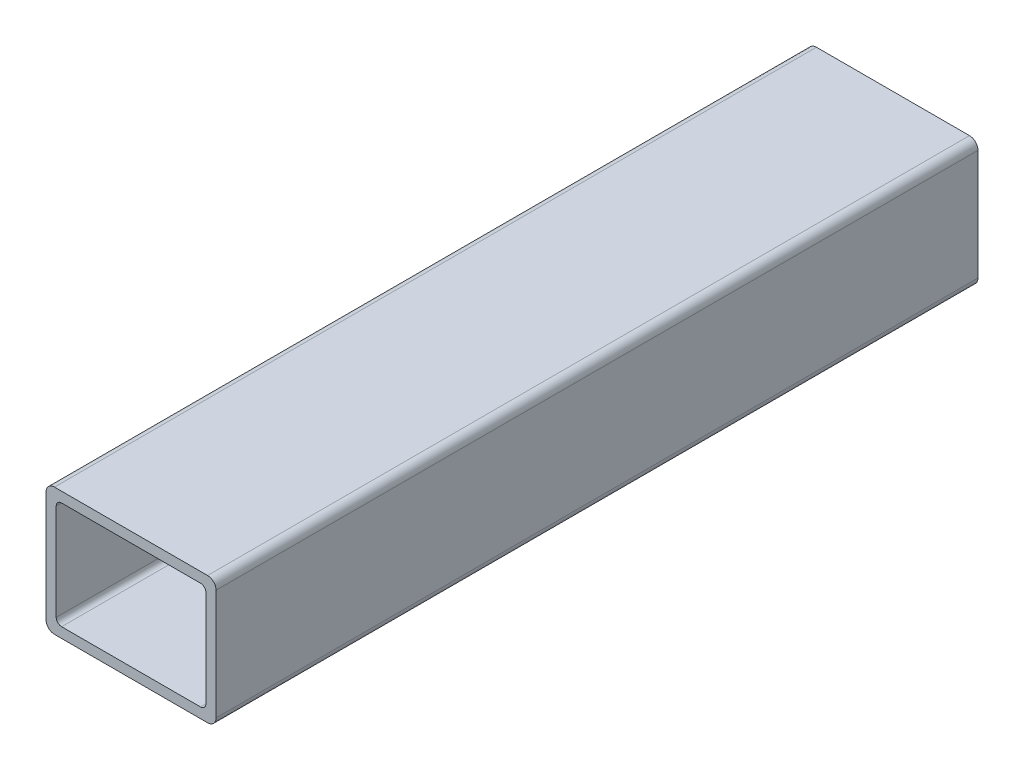
ISO-10303-21;
HEADER;
FILE_DESCRIPTION(('STEP AP214'),'2;1');
FILE_NAME('part.step','',(''),(''),'','','');
FILE_SCHEMA(('AUTOMOTIVE_DESIGN { 1 0 10303 214 1 1 1 1 }'));
ENDSEC;
DATA;
#1=APPLICATION_CONTEXT('core data for automotive mechanical design processes');
#2=APPLICATION_PROTOCOL_DEFINITION('international standard','automotive_design',2000,#1);
#3=PRODUCT_CONTEXT('',#1,'mechanical');
#4=PRODUCT('Part','Part','',(#3));
#5=PRODUCT_RELATED_PRODUCT_CATEGORY('part','',(#4));
#6=PRODUCT_DEFINITION_FORMATION('','',#4);
#7=PRODUCT_DEFINITION_CONTEXT('part definition',#1,'design');
#8=PRODUCT_DEFINITION('design','',#6,#7);
#9=PRODUCT_DEFINITION_SHAPE('','',#8);
#10=(LENGTH_UNIT() NAMED_UNIT(*) SI_UNIT(.MILLI.,.METRE.));
#11=(NAMED_UNIT(*) PLANE_ANGLE_UNIT() SI_UNIT($,.RADIAN.));
#12=(NAMED_UNIT(*) SI_UNIT($,.STERADIAN.) SOLID_ANGLE_UNIT());
#13=UNCERTAINTY_MEASURE_WITH_UNIT(LENGTH_MEASURE(1.E-05),#10,'distance_accuracy_value','');
#14=(GEOMETRIC_REPRESENTATION_CONTEXT(3) GLOBAL_UNCERTAINTY_ASSIGNED_CONTEXT((#13)) GLOBAL_UNIT_ASSIGNED_CONTEXT((#10,
#11,#12)) REPRESENTATION_CONTEXT('',''));
#15=CARTESIAN_POINT('',(0.,0.,0.));
#16=DIRECTION('',(0.,0.,1.));
#17=DIRECTION('',(1.,0.,0.));
#18=AXIS2_PLACEMENT_3D('',#15,#16,#17);
#19=CARTESIAN_POINT('',(22.86,-16.51,227.56368));
#20=DIRECTION('',(0.,0.,1.));
#21=DIRECTION('',(1.,0.,0.));
#22=AXIS2_PLACEMENT_3D('',#19,#20,#21);
#23=PLANE('',#22);
#24=CARTESIAN_POINT('',(22.86,-16.51,227.56368));
#25=DIRECTION('',(0.,0.,1.));
#26=DIRECTION('',(1.,0.,0.));
#27=AXIS2_PLACEMENT_3D('',#24,#25,#26);
#28=CIRCLE('',#27,2.53999999999999);
#29=CARTESIAN_POINT('',(22.86,-19.05,227.56368));
#30=VERTEX_POINT('',#29);
#31=CARTESIAN_POINT('',(25.4,-16.51,227.56368));
#32=VERTEX_POINT('',#31);
#33=EDGE_CURVE('E214',#30,#32,#28,.T.);
#34=ORIENTED_EDGE('',*,*,#33,.T.);
#35=DIRECTION('',(0.,1.,0.));
#36=VECTOR('',#35,1.);
#37=CARTESIAN_POINT('',(25.4,-16.51,227.56368));
#38=LINE('',#37,#36);
#39=CARTESIAN_POINT('',(25.4,16.51,227.56368));
#40=VERTEX_POINT('',#39);
#41=EDGE_CURVE('E217',#32,#40,#38,.T.);
#42=ORIENTED_EDGE('',*,*,#41,.T.);
#43=CARTESIAN_POINT('',(22.86,16.51,227.56368));
#44=DIRECTION('',(0.,0.,1.));
#45=DIRECTION('',(1.,0.,0.));
#46=AXIS2_PLACEMENT_3D('',#43,#44,#45);
#47=CIRCLE('',#46,2.54);
#48=CARTESIAN_POINT('',(22.86,19.05,227.56368));
#49=VERTEX_POINT('',#48);
#50=EDGE_CURVE('E220',#40,#49,#47,.T.);
#51=ORIENTED_EDGE('',*,*,#50,.T.);
#52=DIRECTION('',(-1.,0.,0.));
#53=VECTOR('',#52,1.);
#54=CARTESIAN_POINT('',(22.86,19.05,227.56368));
#55=LINE('',#54,#53);
#56=CARTESIAN_POINT('',(-22.86,19.05,227.56368));
#57=VERTEX_POINT('',#56);
#58=EDGE_CURVE('E222',#49,#57,#55,.T.);
#59=ORIENTED_EDGE('',*,*,#58,.T.);
#60=CARTESIAN_POINT('',(-22.86,16.51,227.56368));
#61=DIRECTION('',(0.,0.,1.));
#62=DIRECTION('',(1.,0.,0.));
#63=AXIS2_PLACEMENT_3D('',#60,#61,#62);
#64=CIRCLE('',#63,2.54);
#65=CARTESIAN_POINT('',(-25.4,16.51,227.56368));
#66=VERTEX_POINT('',#65);
#67=EDGE_CURVE('E224',#57,#66,#64,.T.);
#68=ORIENTED_EDGE('',*,*,#67,.T.);
#69=DIRECTION('',(0.,-1.,0.));
#70=VECTOR('',#69,1.);
#71=CARTESIAN_POINT('',(-25.4,-16.51,227.56368));
#72=LINE('',#71,#70);
#73=CARTESIAN_POINT('',(-25.4,-16.51,227.56368));
#74=VERTEX_POINT('',#73);
#75=EDGE_CURVE('E226',#66,#74,#72,.T.);
#76=ORIENTED_EDGE('',*,*,#75,.T.);
#77=CARTESIAN_POINT('',(-22.86,-16.51,227.56368));
#78=DIRECTION('',(0.,0.,1.));
#79=DIRECTION('',(1.,0.,0.));
#80=AXIS2_PLACEMENT_3D('',#77,#78,#79);
#81=CIRCLE('',#80,2.54);
#82=CARTESIAN_POINT('',(-22.86,-19.05,227.56368));
#83=VERTEX_POINT('',#82);
#84=EDGE_CURVE('E228',#74,#83,#81,.T.);
#85=ORIENTED_EDGE('',*,*,#84,.T.);
#86=DIRECTION('',(1.,0.,0.));
#87=VECTOR('',#86,1.);
#88=CARTESIAN_POINT('',(22.86,-19.05,227.56368));
#89=LINE('',#88,#87);
#90=EDGE_CURVE('E230',#83,#30,#89,.T.);
#91=ORIENTED_EDGE('',*,*,#90,.T.);
#92=EDGE_LOOP('',(#34,#42,#51,#59,#68,#76,#85,#91));
#93=FACE_BOUND('',#92,.T.);
#94=DIRECTION('',(-1.,0.,0.));
#95=VECTOR('',#94,1.);
#96=CARTESIAN_POINT('',(20.7518,16.002,227.56368));
#97=LINE('',#96,#95);
#98=CARTESIAN_POINT('',(20.7518,16.002,227.56368));
#99=VERTEX_POINT('',#98);
#100=CARTESIAN_POINT('',(-20.7518,16.002,227.56368));
#101=VERTEX_POINT('',#100);
#102=EDGE_CURVE('E157',#99,#101,#97,.T.);
#103=ORIENTED_EDGE('',*,*,#102,.F.);
#104=CARTESIAN_POINT('',(20.7518,14.4018,227.56368));
#105=DIRECTION('',(0.,0.,1.));
#106=DIRECTION('',(1.,0.,0.));
#107=AXIS2_PLACEMENT_3D('',#104,#105,#106);
#108=CIRCLE('',#107,1.6002);
#109=CARTESIAN_POINT('',(22.352,14.4018,227.56368));
#110=VERTEX_POINT('',#109);
#111=EDGE_CURVE('E149',#110,#99,#108,.T.);
#112=ORIENTED_EDGE('',*,*,#111,.F.);
#113=DIRECTION('',(0.,1.,0.));
#114=VECTOR('',#113,1.);
#115=CARTESIAN_POINT('',(22.352,14.4018,227.56368));
#116=LINE('',#115,#114);
#117=CARTESIAN_POINT('',(22.352,-14.4018,227.56368));
#118=VERTEX_POINT('',#117);
#119=EDGE_CURVE('E182',#118,#110,#116,.T.);
#120=ORIENTED_EDGE('',*,*,#119,.F.);
#121=CARTESIAN_POINT('',(20.7518,-14.4018,227.56368));
#122=DIRECTION('',(0.,0.,1.));
#123=DIRECTION('',(1.,0.,0.));
#124=AXIS2_PLACEMENT_3D('',#121,#122,#123);
#125=CIRCLE('',#124,1.6002);
#126=CARTESIAN_POINT('',(20.7518,-16.002,227.56368));
#127=VERTEX_POINT('',#126);
#128=EDGE_CURVE('E180',#127,#118,#125,.T.);
#129=ORIENTED_EDGE('',*,*,#128,.F.);
#130=DIRECTION('',(1.,0.,0.));
#131=VECTOR('',#130,1.);
#132=CARTESIAN_POINT('',(20.7518,-16.002,227.56368));
#133=LINE('',#132,#131);
#134=CARTESIAN_POINT('',(-20.7518,-16.002,227.56368));
#135=VERTEX_POINT('',#134);
#136=EDGE_CURVE('E178',#135,#127,#133,.T.);
#137=ORIENTED_EDGE('',*,*,#136,.F.);
#138=CARTESIAN_POINT('',(-20.7518,-14.4018,227.56368));
#139=DIRECTION('',(0.,0.,1.));
#140=DIRECTION('',(1.,0.,0.));
#141=AXIS2_PLACEMENT_3D('',#138,#139,#140);
#142=CIRCLE('',#141,1.6002);
#143=CARTESIAN_POINT('',(-22.352,-14.4018,227.56368));
#144=VERTEX_POINT('',#143);
#145=EDGE_CURVE('E176',#144,#135,#142,.T.);
#146=ORIENTED_EDGE('',*,*,#145,.F.);
#147=DIRECTION('',(0.,-1.,0.));
#148=VECTOR('',#147,1.);
#149=CARTESIAN_POINT('',(-22.352,14.4018,227.56368));
#150=LINE('',#149,#148);
#151=CARTESIAN_POINT('',(-22.352,14.4018,227.56368));
#152=VERTEX_POINT('',#151);
#153=EDGE_CURVE('E172',#152,#144,#150,.T.);
#154=ORIENTED_EDGE('',*,*,#153,.F.);
#155=CARTESIAN_POINT('',(-20.7518,14.4018,227.56368));
#156=DIRECTION('',(0.,0.,1.));
#157=DIRECTION('',(1.,0.,0.));
#158=AXIS2_PLACEMENT_3D('',#155,#156,#157);
#159=CIRCLE('',#158,1.6002);
#160=EDGE_CURVE('E170',#101,#152,#159,.T.);
#161=ORIENTED_EDGE('',*,*,#160,.F.);
#162=EDGE_LOOP('',(#103,#112,#120,#129,#137,#146,#154,#161));
#163=FACE_BOUND('',#162,.T.);
#164=ADVANCED_FACE('F36',(#93,#163),#23,.T.);
#165=CARTESIAN_POINT('',(22.86,-16.51,0.));
#166=DIRECTION('',(0.,0.,1.));
#167=DIRECTION('',(1.,0.,0.));
#168=AXIS2_PLACEMENT_3D('',#165,#166,#167);
#169=PLANE('',#168);
#170=CARTESIAN_POINT('',(22.86,-16.51,0.));
#171=DIRECTION('',(0.,0.,1.));
#172=DIRECTION('',(1.,0.,0.));
#173=AXIS2_PLACEMENT_3D('',#170,#171,#172);
#174=CIRCLE('',#173,2.53999999999999);
#175=CARTESIAN_POINT('',(22.86,-19.05,0.));
#176=VERTEX_POINT('',#175);
#177=CARTESIAN_POINT('',(25.4,-16.51,0.));
#178=VERTEX_POINT('',#177);
#179=EDGE_CURVE('E165',#176,#178,#174,.T.);
#180=ORIENTED_EDGE('',*,*,#179,.F.);
#181=DIRECTION('',(1.,0.,0.));
#182=VECTOR('',#181,1.);
#183=CARTESIAN_POINT('',(22.86,-19.05,0.));
#184=LINE('',#183,#182);
#185=CARTESIAN_POINT('',(-22.86,-19.05,0.));
#186=VERTEX_POINT('',#185);
#187=EDGE_CURVE('E218',#186,#176,#184,.T.);
#188=ORIENTED_EDGE('',*,*,#187,.F.);
#189=CARTESIAN_POINT('',(-22.86,-16.51,0.));
#190=DIRECTION('',(0.,0.,1.));
#191=DIRECTION('',(1.,0.,0.));
#192=AXIS2_PLACEMENT_3D('',#189,#190,#191);
#193=CIRCLE('',#192,2.54);
#194=CARTESIAN_POINT('',(-25.4,-16.51,0.));
#195=VERTEX_POINT('',#194);
#196=EDGE_CURVE('E245',#195,#186,#193,.T.);
#197=ORIENTED_EDGE('',*,*,#196,.F.);
#198=DIRECTION('',(0.,-1.,0.));
#199=VECTOR('',#198,1.);
#200=CARTESIAN_POINT('',(-25.4,-16.51,0.));
#201=LINE('',#200,#199);
#202=CARTESIAN_POINT('',(-25.4,16.51,0.));
#203=VERTEX_POINT('',#202);
#204=EDGE_CURVE('E243',#203,#195,#201,.T.);
#205=ORIENTED_EDGE('',*,*,#204,.F.);
#206=CARTESIAN_POINT('',(-22.86,16.51,0.));
#207=DIRECTION('',(0.,0.,1.));
#208=DIRECTION('',(1.,0.,0.));
#209=AXIS2_PLACEMENT_3D('',#206,#207,#208);
#210=CIRCLE('',#209,2.54);
#211=CARTESIAN_POINT('',(-22.86,19.05,0.));
#212=VERTEX_POINT('',#211);
#213=EDGE_CURVE('E241',#212,#203,#210,.T.);
#214=ORIENTED_EDGE('',*,*,#213,.F.);
#215=DIRECTION('',(-1.,0.,0.));
#216=VECTOR('',#215,1.);
#217=CARTESIAN_POINT('',(22.86,19.05,0.));
#218=LINE('',#217,#216);
#219=CARTESIAN_POINT('',(22.86,19.05,0.));
#220=VERTEX_POINT('',#219);
#221=EDGE_CURVE('E239',#220,#212,#218,.T.);
#222=ORIENTED_EDGE('',*,*,#221,.F.);
#223=CARTESIAN_POINT('',(22.86,16.51,0.));
#224=DIRECTION('',(0.,0.,1.));
#225=DIRECTION('',(1.,0.,0.));
#226=AXIS2_PLACEMENT_3D('',#223,#224,#225);
#227=CIRCLE('',#226,2.54);
#228=CARTESIAN_POINT('',(25.4,16.51,0.));
#229=VERTEX_POINT('',#228);
#230=EDGE_CURVE('E237',#229,#220,#227,.T.);
#231=ORIENTED_EDGE('',*,*,#230,.F.);
#232=DIRECTION('',(0.,1.,0.));
#233=VECTOR('',#232,1.);
#234=CARTESIAN_POINT('',(25.4,-16.51,0.));
#235=LINE('',#234,#233);
#236=EDGE_CURVE('E235',#178,#229,#235,.T.);
#237=ORIENTED_EDGE('',*,*,#236,.F.);
#238=EDGE_LOOP('',(#180,#188,#197,#205,#214,#222,#231,#237));
#239=FACE_BOUND('',#238,.T.);
#240=CARTESIAN_POINT('',(20.7518,14.4018,0.));
#241=DIRECTION('',(0.,0.,1.));
#242=DIRECTION('',(1.,0.,0.));
#243=AXIS2_PLACEMENT_3D('',#240,#241,#242);
#244=CIRCLE('',#243,1.6002);
#245=CARTESIAN_POINT('',(22.352,14.4018,0.));
#246=VERTEX_POINT('',#245);
#247=CARTESIAN_POINT('',(20.7518,16.002,0.));
#248=VERTEX_POINT('',#247);
#249=EDGE_CURVE('E59',#246,#248,#244,.T.);
#250=ORIENTED_EDGE('',*,*,#249,.T.);
#251=DIRECTION('',(-1.,0.,0.));
#252=VECTOR('',#251,1.);
#253=CARTESIAN_POINT('',(20.7518,16.002,0.));
#254=LINE('',#253,#252);
#255=CARTESIAN_POINT('',(-20.7518,16.002,0.));
#256=VERTEX_POINT('',#255);
#257=EDGE_CURVE('E164',#248,#256,#254,.T.);
#258=ORIENTED_EDGE('',*,*,#257,.T.);
#259=CARTESIAN_POINT('',(-20.7518,14.4018,0.));
#260=DIRECTION('',(0.,0.,1.));
#261=DIRECTION('',(1.,0.,0.));
#262=AXIS2_PLACEMENT_3D('',#259,#260,#261);
#263=CIRCLE('',#262,1.6002);
#264=CARTESIAN_POINT('',(-22.352,14.4018,0.));
#265=VERTEX_POINT('',#264);
#266=EDGE_CURVE('E186',#256,#265,#263,.T.);
#267=ORIENTED_EDGE('',*,*,#266,.T.);
#268=DIRECTION('',(0.,-1.,0.));
#269=VECTOR('',#268,1.);
#270=CARTESIAN_POINT('',(-22.352,14.4018,0.));
#271=LINE('',#270,#269);
#272=CARTESIAN_POINT('',(-22.352,-14.4018,0.));
#273=VERTEX_POINT('',#272);
#274=EDGE_CURVE('E189',#265,#273,#271,.T.);
#275=ORIENTED_EDGE('',*,*,#274,.T.);
#276=CARTESIAN_POINT('',(-20.7518,-14.4018,0.));
#277=DIRECTION('',(0.,0.,1.));
#278=DIRECTION('',(1.,0.,0.));
#279=AXIS2_PLACEMENT_3D('',#276,#277,#278);
#280=CIRCLE('',#279,1.6002);
#281=CARTESIAN_POINT('',(-20.7518,-16.002,0.));
#282=VERTEX_POINT('',#281);
#283=EDGE_CURVE('E192',#273,#282,#280,.T.);
#284=ORIENTED_EDGE('',*,*,#283,.T.);
#285=DIRECTION('',(1.,0.,0.));
#286=VECTOR('',#285,1.);
#287=CARTESIAN_POINT('',(20.7518,-16.002,0.));
#288=LINE('',#287,#286);
#289=CARTESIAN_POINT('',(20.7518,-16.002,0.));
#290=VERTEX_POINT('',#289);
#291=EDGE_CURVE('E195',#282,#290,#288,.T.);
#292=ORIENTED_EDGE('',*,*,#291,.T.);
#293=CARTESIAN_POINT('',(20.7518,-14.4018,0.));
#294=DIRECTION('',(0.,0.,1.));
#295=DIRECTION('',(1.,0.,0.));
#296=AXIS2_PLACEMENT_3D('',#293,#294,#295);
#297=CIRCLE('',#296,1.6002);
#298=CARTESIAN_POINT('',(22.352,-14.4018,0.));
#299=VERTEX_POINT('',#298);
#300=EDGE_CURVE('E198',#290,#299,#297,.T.);
#301=ORIENTED_EDGE('',*,*,#300,.T.);
#302=DIRECTION('',(0.,1.,0.));
#303=VECTOR('',#302,1.);
#304=CARTESIAN_POINT('',(22.352,14.4018,0.));
#305=LINE('',#304,#303);
#306=EDGE_CURVE('E158',#299,#246,#305,.T.);
#307=ORIENTED_EDGE('',*,*,#306,.T.);
#308=EDGE_LOOP('',(#250,#258,#267,#275,#284,#292,#301,#307));
#309=FACE_BOUND('',#308,.T.);
#310=ADVANCED_FACE('F275',(#239,#309),#169,.F.);
#311=CARTESIAN_POINT('',(22.86,-16.51,227.56368));
#312=DIRECTION('',(0.,0.,-1.));
#313=DIRECTION('',(-1.,0.,0.));
#314=AXIS2_PLACEMENT_3D('',#311,#312,#313);
#315=CYLINDRICAL_SURFACE('',#314,2.53999999999999);
#316=ORIENTED_EDGE('',*,*,#179,.T.);
#317=DIRECTION('',(0.,0.,-1.));
#318=VECTOR('',#317,1.);
#319=CARTESIAN_POINT('',(25.4,-16.51,227.56368));
#320=LINE('',#319,#318);
#321=EDGE_CURVE('E11',#32,#178,#320,.T.);
#322=ORIENTED_EDGE('',*,*,#321,.F.);
#323=ORIENTED_EDGE('',*,*,#33,.F.);
#324=DIRECTION('',(0.,0.,-1.));
#325=VECTOR('',#324,1.);
#326=CARTESIAN_POINT('',(22.86,-19.05,227.56368));
#327=LINE('',#326,#325);
#328=EDGE_CURVE('E232',#30,#176,#327,.T.);
#329=ORIENTED_EDGE('',*,*,#328,.T.);
#330=EDGE_LOOP('',(#316,#322,#323,#329));
#331=FACE_BOUND('',#330,.T.);
#332=ADVANCED_FACE('F38',(#331),#315,.T.);
#333=CARTESIAN_POINT('',(25.4,-16.51,227.56368));
#334=DIRECTION('',(-1.,0.,0.));
#335=DIRECTION('',(0.,0.,1.));
#336=AXIS2_PLACEMENT_3D('',#333,#334,#335);
#337=PLANE('',#336);
#338=ORIENTED_EDGE('',*,*,#236,.T.);
#339=DIRECTION('',(0.,0.,-1.));
#340=VECTOR('',#339,1.);
#341=CARTESIAN_POINT('',(25.4,16.51,227.56368));
#342=LINE('',#341,#340);
#343=EDGE_CURVE('E44',#40,#229,#342,.T.);
#344=ORIENTED_EDGE('',*,*,#343,.F.);
#345=ORIENTED_EDGE('',*,*,#41,.F.);
#346=ORIENTED_EDGE('',*,*,#321,.T.);
#347=EDGE_LOOP('',(#338,#344,#345,#346));
#348=FACE_BOUND('',#347,.T.);
#349=ADVANCED_FACE('F292',(#348),#337,.F.);
#350=CARTESIAN_POINT('',(22.86,16.51,227.56368));
#351=DIRECTION('',(0.,0.,-1.));
#352=DIRECTION('',(-1.,0.,0.));
#353=AXIS2_PLACEMENT_3D('',#350,#351,#352);
#354=CYLINDRICAL_SURFACE('',#353,2.54);
#355=ORIENTED_EDGE('',*,*,#230,.T.);
#356=DIRECTION('',(0.,0.,-1.));
#357=VECTOR('',#356,1.);
#358=CARTESIAN_POINT('',(22.86,19.05,227.56368));
#359=LINE('',#358,#357);
#360=EDGE_CURVE('E262',#49,#220,#359,.T.);
#361=ORIENTED_EDGE('',*,*,#360,.F.);
#362=ORIENTED_EDGE('',*,*,#50,.F.);
#363=ORIENTED_EDGE('',*,*,#343,.T.);
#364=EDGE_LOOP('',(#355,#361,#362,#363));
#365=FACE_BOUND('',#364,.T.);
#366=ADVANCED_FACE('F269',(#365),#354,.T.);
#367=CARTESIAN_POINT('',(22.86,19.05,227.56368));
#368=DIRECTION('',(0.,-1.,0.));
#369=DIRECTION('',(0.,0.,-1.));
#370=AXIS2_PLACEMENT_3D('',#367,#368,#369);
#371=PLANE('',#370);
#372=ORIENTED_EDGE('',*,*,#221,.T.);
#373=DIRECTION('',(0.,0.,-1.));
#374=VECTOR('',#373,1.);
#375=CARTESIAN_POINT('',(-22.86,19.05,227.56368));
#376=LINE('',#375,#374);
#377=EDGE_CURVE('E259',#57,#212,#376,.T.);
#378=ORIENTED_EDGE('',*,*,#377,.F.);
#379=ORIENTED_EDGE('',*,*,#58,.F.);
#380=ORIENTED_EDGE('',*,*,#360,.T.);
#381=EDGE_LOOP('',(#372,#378,#379,#380));
#382=FACE_BOUND('',#381,.T.);
#383=ADVANCED_FACE('F281',(#382),#371,.F.);
#384=CARTESIAN_POINT('',(-22.86,16.51,227.56368));
#385=DIRECTION('',(0.,0.,-1.));
#386=DIRECTION('',(-1.,0.,0.));
#387=AXIS2_PLACEMENT_3D('',#384,#385,#386);
#388=CYLINDRICAL_SURFACE('',#387,2.54);
#389=ORIENTED_EDGE('',*,*,#213,.T.);
#390=DIRECTION('',(0.,0.,-1.));
#391=VECTOR('',#390,1.);
#392=CARTESIAN_POINT('',(-25.4,16.51,227.56368));
#393=LINE('',#392,#391);
#394=EDGE_CURVE('E256',#66,#203,#393,.T.);
#395=ORIENTED_EDGE('',*,*,#394,.F.);
#396=ORIENTED_EDGE('',*,*,#67,.F.);
#397=ORIENTED_EDGE('',*,*,#377,.T.);
#398=EDGE_LOOP('',(#389,#395,#396,#397));
#399=FACE_BOUND('',#398,.T.);
#400=ADVANCED_FACE('F285',(#399),#388,.T.);
#401=CARTESIAN_POINT('',(-25.4,-16.51,227.56368));
#402=DIRECTION('',(1.,0.,0.));
#403=DIRECTION('',(0.,1.,0.));
#404=AXIS2_PLACEMENT_3D('',#401,#402,#403);
#405=PLANE('',#404);
#406=ORIENTED_EDGE('',*,*,#204,.T.);
#407=DIRECTION('',(0.,0.,-1.));
#408=VECTOR('',#407,1.);
#409=CARTESIAN_POINT('',(-25.4,-16.51,227.56368));
#410=LINE('',#409,#408);
#411=EDGE_CURVE('E253',#74,#195,#410,.T.);
#412=ORIENTED_EDGE('',*,*,#411,.F.);
#413=ORIENTED_EDGE('',*,*,#75,.F.);
#414=ORIENTED_EDGE('',*,*,#394,.T.);
#415=EDGE_LOOP('',(#406,#412,#413,#414));
#416=FACE_BOUND('',#415,.T.);
#417=ADVANCED_FACE('F305',(#416),#405,.F.);
#418=CARTESIAN_POINT('',(-22.86,-16.51,227.56368));
#419=DIRECTION('',(0.,0.,-1.));
#420=DIRECTION('',(-1.,0.,0.));
#421=AXIS2_PLACEMENT_3D('',#418,#419,#420);
#422=CYLINDRICAL_SURFACE('',#421,2.54);
#423=ORIENTED_EDGE('',*,*,#196,.T.);
#424=DIRECTION('',(0.,0.,-1.));
#425=VECTOR('',#424,1.);
#426=CARTESIAN_POINT('',(-22.86,-19.05,227.56368));
#427=LINE('',#426,#425);
#428=EDGE_CURVE('E250',#83,#186,#427,.T.);
#429=ORIENTED_EDGE('',*,*,#428,.F.);
#430=ORIENTED_EDGE('',*,*,#84,.F.);
#431=ORIENTED_EDGE('',*,*,#411,.T.);
#432=EDGE_LOOP('',(#423,#429,#430,#431));
#433=FACE_BOUND('',#432,.T.);
#434=ADVANCED_FACE('F303',(#433),#422,.T.);
#435=CARTESIAN_POINT('',(22.86,-19.05,227.56368));
#436=DIRECTION('',(0.,1.,0.));
#437=DIRECTION('',(-1.,0.,0.));
#438=AXIS2_PLACEMENT_3D('',#435,#436,#437);
#439=PLANE('',#438);
#440=ORIENTED_EDGE('',*,*,#187,.T.);
#441=ORIENTED_EDGE('',*,*,#328,.F.);
#442=ORIENTED_EDGE('',*,*,#90,.F.);
#443=ORIENTED_EDGE('',*,*,#428,.T.);
#444=EDGE_LOOP('',(#440,#441,#442,#443));
#445=FACE_BOUND('',#444,.T.);
#446=ADVANCED_FACE('F298',(#445),#439,.F.);
#447=CARTESIAN_POINT('',(20.7518,14.4018,227.56368));
#448=DIRECTION('',(0.,0.,-1.));
#449=DIRECTION('',(-1.,0.,0.));
#450=AXIS2_PLACEMENT_3D('',#447,#448,#449);
#451=CYLINDRICAL_SURFACE('',#450,1.6002);
#452=ORIENTED_EDGE('',*,*,#249,.F.);
#453=DIRECTION('',(0.,0.,-1.));
#454=VECTOR('',#453,1.);
#455=CARTESIAN_POINT('',(22.352,14.4018,227.56368));
#456=LINE('',#455,#454);
#457=EDGE_CURVE('E153',#110,#246,#456,.T.);
#458=ORIENTED_EDGE('',*,*,#457,.F.);
#459=ORIENTED_EDGE('',*,*,#111,.T.);
#460=DIRECTION('',(0.,0.,-1.));
#461=VECTOR('',#460,1.);
#462=CARTESIAN_POINT('',(20.7518,16.002,227.56368));
#463=LINE('',#462,#461);
#464=EDGE_CURVE('E152',#99,#248,#463,.T.);
#465=ORIENTED_EDGE('',*,*,#464,.T.);
#466=EDGE_LOOP('',(#452,#458,#459,#465));
#467=FACE_BOUND('',#466,.T.);
#468=ADVANCED_FACE('F151',(#467),#451,.F.);
#469=CARTESIAN_POINT('',(20.7518,16.002,227.56368));
#470=DIRECTION('',(0.,-1.,0.));
#471=DIRECTION('',(1.,0.,0.));
#472=AXIS2_PLACEMENT_3D('',#469,#470,#471);
#473=PLANE('',#472);
#474=ORIENTED_EDGE('',*,*,#257,.F.);
#475=ORIENTED_EDGE('',*,*,#464,.F.);
#476=ORIENTED_EDGE('',*,*,#102,.T.);
#477=DIRECTION('',(0.,0.,-1.));
#478=VECTOR('',#477,1.);
#479=CARTESIAN_POINT('',(-20.7518,16.002,227.56368));
#480=LINE('',#479,#478);
#481=EDGE_CURVE('E166',#101,#256,#480,.T.);
#482=ORIENTED_EDGE('',*,*,#481,.T.);
#483=EDGE_LOOP('',(#474,#475,#476,#482));
#484=FACE_BOUND('',#483,.T.);
#485=ADVANCED_FACE('F161',(#484),#473,.T.);
#486=CARTESIAN_POINT('',(-20.7518,14.4018,227.56368));
#487=DIRECTION('',(0.,0.,-1.));
#488=DIRECTION('',(-1.,0.,0.));
#489=AXIS2_PLACEMENT_3D('',#486,#487,#488);
#490=CYLINDRICAL_SURFACE('',#489,1.6002);
#491=ORIENTED_EDGE('',*,*,#266,.F.);
#492=ORIENTED_EDGE('',*,*,#481,.F.);
#493=ORIENTED_EDGE('',*,*,#160,.T.);
#494=DIRECTION('',(0.,0.,-1.));
#495=VECTOR('',#494,1.);
#496=CARTESIAN_POINT('',(-22.352,14.4018,227.56368));
#497=LINE('',#496,#495);
#498=EDGE_CURVE('E211',#152,#265,#497,.T.);
#499=ORIENTED_EDGE('',*,*,#498,.T.);
#500=EDGE_LOOP('',(#491,#492,#493,#499));
#501=FACE_BOUND('',#500,.T.);
#502=ADVANCED_FACE('F330',(#501),#490,.F.);
#503=CARTESIAN_POINT('',(-22.352,14.4018,227.56368));
#504=DIRECTION('',(1.,0.,0.));
#505=DIRECTION('',(0.,1.,0.));
#506=AXIS2_PLACEMENT_3D('',#503,#504,#505);
#507=PLANE('',#506);
#508=ORIENTED_EDGE('',*,*,#274,.F.);
#509=ORIENTED_EDGE('',*,*,#498,.F.);
#510=ORIENTED_EDGE('',*,*,#153,.T.);
#511=DIRECTION('',(0.,0.,-1.));
#512=VECTOR('',#511,1.);
#513=CARTESIAN_POINT('',(-22.352,-14.4018,227.56368));
#514=LINE('',#513,#512);
#515=EDGE_CURVE('E209',#144,#273,#514,.T.);
#516=ORIENTED_EDGE('',*,*,#515,.T.);
#517=EDGE_LOOP('',(#508,#509,#510,#516));
#518=FACE_BOUND('',#517,.T.);
#519=ADVANCED_FACE('F334',(#518),#507,.T.);
#520=CARTESIAN_POINT('',(-20.7518,-14.4018,227.56368));
#521=DIRECTION('',(0.,0.,-1.));
#522=DIRECTION('',(-1.,0.,0.));
#523=AXIS2_PLACEMENT_3D('',#520,#521,#522);
#524=CYLINDRICAL_SURFACE('',#523,1.6002);
#525=ORIENTED_EDGE('',*,*,#283,.F.);
#526=ORIENTED_EDGE('',*,*,#515,.F.);
#527=ORIENTED_EDGE('',*,*,#145,.T.);
#528=DIRECTION('',(0.,0.,-1.));
#529=VECTOR('',#528,1.);
#530=CARTESIAN_POINT('',(-20.7518,-16.002,227.56368));
#531=LINE('',#530,#529);
#532=EDGE_CURVE('E207',#135,#282,#531,.T.);
#533=ORIENTED_EDGE('',*,*,#532,.T.);
#534=EDGE_LOOP('',(#525,#526,#527,#533));
#535=FACE_BOUND('',#534,.T.);
#536=ADVANCED_FACE('F340',(#535),#524,.F.);
#537=CARTESIAN_POINT('',(20.7518,-16.002,227.56368));
#538=DIRECTION('',(0.,1.,0.));
#539=DIRECTION('',(-1.,0.,0.));
#540=AXIS2_PLACEMENT_3D('',#537,#538,#539);
#541=PLANE('',#540);
#542=ORIENTED_EDGE('',*,*,#291,.F.);
#543=ORIENTED_EDGE('',*,*,#532,.F.);
#544=ORIENTED_EDGE('',*,*,#136,.T.);
#545=DIRECTION('',(0.,0.,-1.));
#546=VECTOR('',#545,1.);
#547=CARTESIAN_POINT('',(20.7518,-16.002,227.56368));
#548=LINE('',#547,#546);
#549=EDGE_CURVE('E205',#127,#290,#548,.T.);
#550=ORIENTED_EDGE('',*,*,#549,.T.);
#551=EDGE_LOOP('',(#542,#543,#544,#550));
#552=FACE_BOUND('',#551,.T.);
#553=ADVANCED_FACE('F344',(#552),#541,.T.);
#554=CARTESIAN_POINT('',(20.7518,-14.4018,227.56368));
#555=DIRECTION('',(0.,0.,-1.));
#556=DIRECTION('',(-1.,0.,0.));
#557=AXIS2_PLACEMENT_3D('',#554,#555,#556);
#558=CYLINDRICAL_SURFACE('',#557,1.6002);
#559=ORIENTED_EDGE('',*,*,#300,.F.);
#560=ORIENTED_EDGE('',*,*,#549,.F.);
#561=ORIENTED_EDGE('',*,*,#128,.T.);
#562=DIRECTION('',(0.,0.,-1.));
#563=VECTOR('',#562,1.);
#564=CARTESIAN_POINT('',(22.352,-14.4018,227.56368));
#565=LINE('',#564,#563);
#566=EDGE_CURVE('E51',#118,#299,#565,.T.);
#567=ORIENTED_EDGE('',*,*,#566,.T.);
#568=EDGE_LOOP('',(#559,#560,#561,#567));
#569=FACE_BOUND('',#568,.T.);
#570=ADVANCED_FACE('F348',(#569),#558,.F.);
#571=CARTESIAN_POINT('',(22.352,14.4018,227.56368));
#572=DIRECTION('',(-1.,0.,0.));
#573=DIRECTION('',(0.,-1.,0.));
#574=AXIS2_PLACEMENT_3D('',#571,#572,#573);
#575=PLANE('',#574);
#576=ORIENTED_EDGE('',*,*,#306,.F.);
#577=ORIENTED_EDGE('',*,*,#566,.F.);
#578=ORIENTED_EDGE('',*,*,#119,.T.);
#579=ORIENTED_EDGE('',*,*,#457,.T.);
#580=EDGE_LOOP('',(#576,#577,#578,#579));
#581=FACE_BOUND('',#580,.T.);
#582=ADVANCED_FACE('F352',(#581),#575,.T.);
#583=CLOSED_SHELL('',(#164,#310,#332,#349,#366,#383,#400,#417,#434,#446,#468,#485,#502,#519,
#536,#553,#570,#582));
#584=MANIFOLD_SOLID_BREP('B2',#583);
#585=ADVANCED_BREP_SHAPE_REPRESENTATION('',(#18,#584),#14);
#586=SHAPE_DEFINITION_REPRESENTATION(#9,#585);
ENDSEC;
END-ISO-10303-21;
